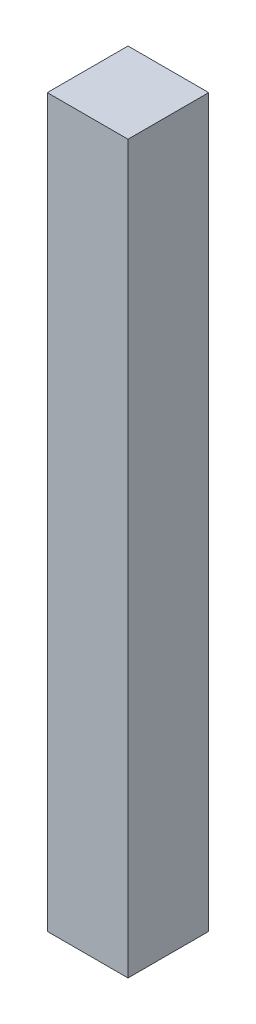
ISO-10303-21;
HEADER;
FILE_DESCRIPTION(('STEP AP214'),'2;1');
FILE_NAME('part.step','',(''),(''),'','','');
FILE_SCHEMA(('AUTOMOTIVE_DESIGN { 1 0 10303 214 1 1 1 1 }'));
ENDSEC;
DATA;
#1=APPLICATION_CONTEXT('core data for automotive mechanical design processes');
#2=APPLICATION_PROTOCOL_DEFINITION('international standard','automotive_design',2000,#1);
#3=PRODUCT_CONTEXT('',#1,'mechanical');
#4=PRODUCT('Part','Part','',(#3));
#5=PRODUCT_RELATED_PRODUCT_CATEGORY('part','',(#4));
#6=PRODUCT_DEFINITION_FORMATION('','',#4);
#7=PRODUCT_DEFINITION_CONTEXT('part definition',#1,'design');
#8=PRODUCT_DEFINITION('design','',#6,#7);
#9=PRODUCT_DEFINITION_SHAPE('','',#8);
#10=(LENGTH_UNIT() NAMED_UNIT(*) SI_UNIT(.MILLI.,.METRE.));
#11=(NAMED_UNIT(*) PLANE_ANGLE_UNIT() SI_UNIT($,.RADIAN.));
#12=(NAMED_UNIT(*) SI_UNIT($,.STERADIAN.) SOLID_ANGLE_UNIT());
#13=UNCERTAINTY_MEASURE_WITH_UNIT(LENGTH_MEASURE(1.E-05),#10,'distance_accuracy_value','');
#14=(GEOMETRIC_REPRESENTATION_CONTEXT(3) GLOBAL_UNCERTAINTY_ASSIGNED_CONTEXT((#13)) GLOBAL_UNIT_ASSIGNED_CONTEXT((#10,
#11,#12)) REPRESENTATION_CONTEXT('',''));
#15=CARTESIAN_POINT('',(0.,0.,0.));
#16=DIRECTION('',(0.,0.,1.));
#17=DIRECTION('',(1.,0.,0.));
#18=AXIS2_PLACEMENT_3D('',#15,#16,#17);
#19=CARTESIAN_POINT('',(0.,180.,0.));
#20=DIRECTION('',(-1.,0.,0.));
#21=DIRECTION('',(0.,0.,1.));
#22=AXIS2_PLACEMENT_3D('',#19,#20,#21);
#23=PLANE('',#22);
#24=DIRECTION('',(0.,0.,-1.));
#25=VECTOR('',#24,1.);
#26=CARTESIAN_POINT('',(0.,0.,0.));
#27=LINE('',#26,#25);
#28=CARTESIAN_POINT('',(0.,0.,0.));
#29=VERTEX_POINT('',#28);
#30=CARTESIAN_POINT('',(0.,0.,-20.));
#31=VERTEX_POINT('',#30);
#32=EDGE_CURVE('E96',#29,#31,#27,.T.);
#33=ORIENTED_EDGE('',*,*,#32,.T.);
#34=DIRECTION('',(0.,-1.,0.));
#35=VECTOR('',#34,1.);
#36=CARTESIAN_POINT('',(0.,180.,-20.));
#37=LINE('',#36,#35);
#38=CARTESIAN_POINT('',(0.,180.,-20.));
#39=VERTEX_POINT('',#38);
#40=EDGE_CURVE('E11',#39,#31,#37,.T.);
#41=ORIENTED_EDGE('',*,*,#40,.F.);
#42=DIRECTION('',(0.,0.,-1.));
#43=VECTOR('',#42,1.);
#44=CARTESIAN_POINT('',(0.,180.,0.));
#45=LINE('',#44,#43);
#46=CARTESIAN_POINT('',(0.,180.,0.));
#47=VERTEX_POINT('',#46);
#48=EDGE_CURVE('E84',#47,#39,#45,.T.);
#49=ORIENTED_EDGE('',*,*,#48,.F.);
#50=DIRECTION('',(0.,-1.,0.));
#51=VECTOR('',#50,1.);
#52=CARTESIAN_POINT('',(0.,180.,0.));
#53=LINE('',#52,#51);
#54=EDGE_CURVE('E92',#47,#29,#53,.T.);
#55=ORIENTED_EDGE('',*,*,#54,.T.);
#56=EDGE_LOOP('',(#33,#41,#49,#55));
#57=FACE_BOUND('',#56,.T.);
#58=ADVANCED_FACE('F33',(#57),#23,.F.);
#59=CARTESIAN_POINT('',(0.,180.,-20.));
#60=DIRECTION('',(0.,0.,1.));
#61=DIRECTION('',(1.,0.,0.));
#62=AXIS2_PLACEMENT_3D('',#59,#60,#61);
#63=PLANE('',#62);
#64=DIRECTION('',(-1.,0.,0.));
#65=VECTOR('',#64,1.);
#66=CARTESIAN_POINT('',(0.,0.,-20.));
#67=LINE('',#66,#65);
#68=CARTESIAN_POINT('',(-20.,0.,-20.));
#69=VERTEX_POINT('',#68);
#70=EDGE_CURVE('E88',#31,#69,#67,.T.);
#71=ORIENTED_EDGE('',*,*,#70,.T.);
#72=DIRECTION('',(0.,-1.,0.));
#73=VECTOR('',#72,1.);
#74=CARTESIAN_POINT('',(-20.,180.,-20.));
#75=LINE('',#74,#73);
#76=CARTESIAN_POINT('',(-20.,180.,-20.));
#77=VERTEX_POINT('',#76);
#78=EDGE_CURVE('E41',#77,#69,#75,.T.);
#79=ORIENTED_EDGE('',*,*,#78,.F.);
#80=DIRECTION('',(-1.,0.,0.));
#81=VECTOR('',#80,1.);
#82=CARTESIAN_POINT('',(0.,180.,-20.));
#83=LINE('',#82,#81);
#84=EDGE_CURVE('E79',#39,#77,#83,.T.);
#85=ORIENTED_EDGE('',*,*,#84,.F.);
#86=ORIENTED_EDGE('',*,*,#40,.T.);
#87=EDGE_LOOP('',(#71,#79,#85,#86));
#88=FACE_BOUND('',#87,.T.);
#89=ADVANCED_FACE('F87',(#88),#63,.F.);
#90=CARTESIAN_POINT('',(-20.,180.,0.));
#91=DIRECTION('',(1.,0.,0.));
#92=DIRECTION('',(0.,0.,-1.));
#93=AXIS2_PLACEMENT_3D('',#90,#91,#92);
#94=PLANE('',#93);
#95=DIRECTION('',(0.,0.,1.));
#96=VECTOR('',#95,1.);
#97=CARTESIAN_POINT('',(-20.,0.,0.));
#98=LINE('',#97,#96);
#99=CARTESIAN_POINT('',(-20.,0.,0.));
#100=VERTEX_POINT('',#99);
#101=EDGE_CURVE('E66',#69,#100,#98,.T.);
#102=ORIENTED_EDGE('',*,*,#101,.T.);
#103=DIRECTION('',(0.,-1.,0.));
#104=VECTOR('',#103,1.);
#105=CARTESIAN_POINT('',(-20.,180.,0.));
#106=LINE('',#105,#104);
#107=CARTESIAN_POINT('',(-20.,180.,0.));
#108=VERTEX_POINT('',#107);
#109=EDGE_CURVE('E89',#108,#100,#106,.T.);
#110=ORIENTED_EDGE('',*,*,#109,.F.);
#111=DIRECTION('',(0.,0.,1.));
#112=VECTOR('',#111,1.);
#113=CARTESIAN_POINT('',(-20.,180.,0.));
#114=LINE('',#113,#112);
#115=EDGE_CURVE('E82',#77,#108,#114,.T.);
#116=ORIENTED_EDGE('',*,*,#115,.F.);
#117=ORIENTED_EDGE('',*,*,#78,.T.);
#118=EDGE_LOOP('',(#102,#110,#116,#117));
#119=FACE_BOUND('',#118,.T.);
#120=ADVANCED_FACE('F90',(#119),#94,.F.);
#121=CARTESIAN_POINT('',(0.,180.,0.));
#122=DIRECTION('',(0.,0.,-1.));
#123=DIRECTION('',(-1.,0.,0.));
#124=AXIS2_PLACEMENT_3D('',#121,#122,#123);
#125=PLANE('',#124);
#126=DIRECTION('',(1.,0.,0.));
#127=VECTOR('',#126,1.);
#128=CARTESIAN_POINT('',(0.,0.,0.));
#129=LINE('',#128,#127);
#130=EDGE_CURVE('E72',#100,#29,#129,.T.);
#131=ORIENTED_EDGE('',*,*,#130,.T.);
#132=ORIENTED_EDGE('',*,*,#54,.F.);
#133=DIRECTION('',(1.,0.,0.));
#134=VECTOR('',#133,1.);
#135=CARTESIAN_POINT('',(0.,180.,0.));
#136=LINE('',#135,#134);
#137=EDGE_CURVE('E49',#108,#47,#136,.T.);
#138=ORIENTED_EDGE('',*,*,#137,.F.);
#139=ORIENTED_EDGE('',*,*,#109,.T.);
#140=EDGE_LOOP('',(#131,#132,#138,#139));
#141=FACE_BOUND('',#140,.T.);
#142=ADVANCED_FACE('F103',(#141),#125,.F.);
#143=CARTESIAN_POINT('',(0.,180.,0.));
#144=DIRECTION('',(0.,1.,0.));
#145=DIRECTION('',(0.,0.,1.));
#146=AXIS2_PLACEMENT_3D('',#143,#144,#145);
#147=PLANE('',#146);
#148=ORIENTED_EDGE('',*,*,#48,.T.);
#149=ORIENTED_EDGE('',*,*,#84,.T.);
#150=ORIENTED_EDGE('',*,*,#115,.T.);
#151=ORIENTED_EDGE('',*,*,#137,.T.);
#152=EDGE_LOOP('',(#148,#149,#150,#151));
#153=FACE_BOUND('',#152,.T.);
#154=ADVANCED_FACE('F80',(#153),#147,.T.);
#155=CARTESIAN_POINT('',(0.,0.,0.));
#156=DIRECTION('',(0.,1.,0.));
#157=DIRECTION('',(0.,0.,1.));
#158=AXIS2_PLACEMENT_3D('',#155,#156,#157);
#159=PLANE('',#158);
#160=ORIENTED_EDGE('',*,*,#32,.F.);
#161=ORIENTED_EDGE('',*,*,#130,.F.);
#162=ORIENTED_EDGE('',*,*,#101,.F.);
#163=ORIENTED_EDGE('',*,*,#70,.F.);
#164=EDGE_LOOP('',(#160,#161,#162,#163));
#165=FACE_BOUND('',#164,.T.);
#166=ADVANCED_FACE('F106',(#165),#159,.F.);
#167=CLOSED_SHELL('',(#58,#89,#120,#142,#154,#166));
#168=MANIFOLD_SOLID_BREP('B2',#167);
#169=ADVANCED_BREP_SHAPE_REPRESENTATION('',(#18,#168),#14);
#170=SHAPE_DEFINITION_REPRESENTATION(#9,#169);
ENDSEC;
END-ISO-10303-21;
